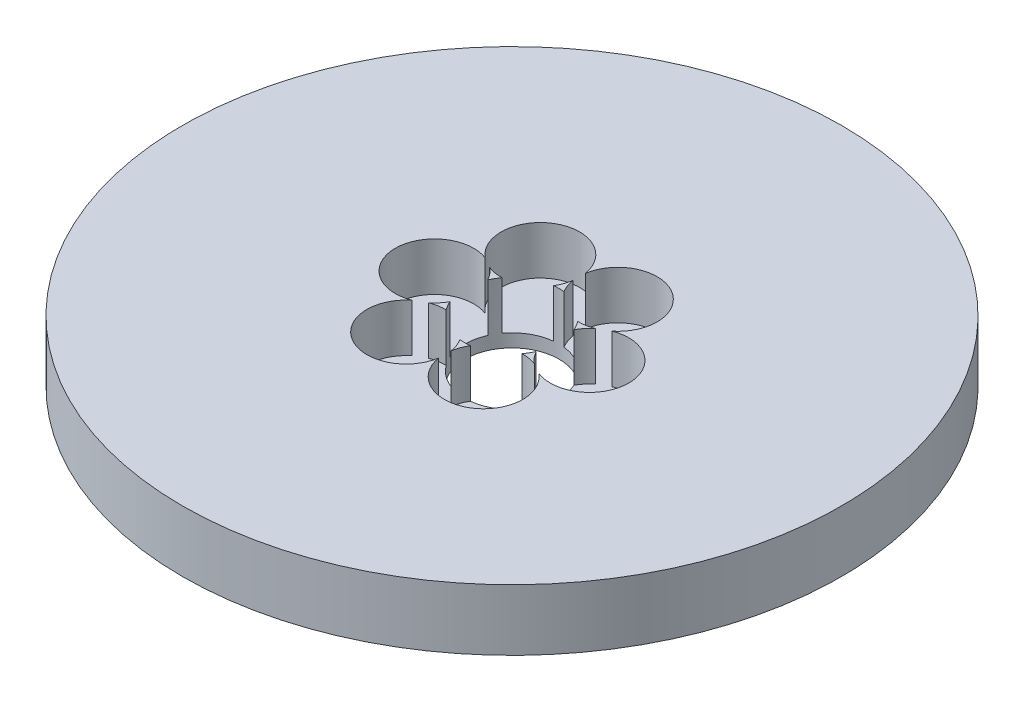
ISO-10303-21;
HEADER;
FILE_DESCRIPTION(('STEP AP214'),'2;1');
FILE_NAME('part.step','',(''),(''),'','','');
FILE_SCHEMA(('AUTOMOTIVE_DESIGN { 1 0 10303 214 1 1 1 1 }'));
ENDSEC;
DATA;
#1=APPLICATION_CONTEXT('core data for automotive mechanical design processes');
#2=APPLICATION_PROTOCOL_DEFINITION('international standard','automotive_design',2000,#1);
#3=PRODUCT_CONTEXT('',#1,'mechanical');
#4=PRODUCT('Part','Part','',(#3));
#5=PRODUCT_RELATED_PRODUCT_CATEGORY('part','',(#4));
#6=PRODUCT_DEFINITION_FORMATION('','',#4);
#7=PRODUCT_DEFINITION_CONTEXT('part definition',#1,'design');
#8=PRODUCT_DEFINITION('design','',#6,#7);
#9=PRODUCT_DEFINITION_SHAPE('','',#8);
#10=(LENGTH_UNIT() NAMED_UNIT(*) SI_UNIT(.MILLI.,.METRE.));
#11=(NAMED_UNIT(*) PLANE_ANGLE_UNIT() SI_UNIT($,.RADIAN.));
#12=(NAMED_UNIT(*) SI_UNIT($,.STERADIAN.) SOLID_ANGLE_UNIT());
#13=UNCERTAINTY_MEASURE_WITH_UNIT(LENGTH_MEASURE(1.E-05),#10,'distance_accuracy_value','');
#14=(GEOMETRIC_REPRESENTATION_CONTEXT(3) GLOBAL_UNCERTAINTY_ASSIGNED_CONTEXT((#13)) GLOBAL_UNIT_ASSIGNED_CONTEXT((#10,
#11,#12)) REPRESENTATION_CONTEXT('',''));
#15=CARTESIAN_POINT('',(0.,0.,0.));
#16=DIRECTION('',(0.,0.,1.));
#17=DIRECTION('',(1.,0.,0.));
#18=AXIS2_PLACEMENT_3D('',#15,#16,#17);
#19=CARTESIAN_POINT('',(0.,13.,0.));
#20=DIRECTION('',(0.,1.,0.));
#21=DIRECTION('',(0.,0.,1.));
#22=AXIS2_PLACEMENT_3D('',#19,#20,#21);
#23=PLANE('',#22);
#24=CARTESIAN_POINT('',(-8.23171814676589,13.,14.2577540637853));
#25=DIRECTION('',(0.,1.,0.));
#26=DIRECTION('',(0.86602540378444,0.,0.499999999999998));
#27=AXIS2_PLACEMENT_3D('',#24,#25,#26);
#28=CIRCLE('',#27,8.33407657568509);
#29=CARTESIAN_POINT('',(-8.05530373037074,13.,5.92554485355357));
#30=VERTEX_POINT('',#29);
#31=CARTESIAN_POINT('',(-11.219864250821,13.,6.47779164548255));
#32=VERTEX_POINT('',#31);
#33=EDGE_CURVE('E298',#30,#32,#28,.T.);
#34=ORIENTED_EDGE('',*,*,#33,.F.);
#35=CARTESIAN_POINT('',(0.,13.,0.));
#36=DIRECTION('',(0.,1.,0.));
#37=DIRECTION('',(0.,0.,1.));
#38=AXIS2_PLACEMENT_3D('',#35,#36,#37);
#39=CIRCLE('',#38,10.);
#40=CARTESIAN_POINT('',(-9.15932423962689,13.,4.01332523892386));
#41=VERTEX_POINT('',#40);
#42=EDGE_CURVE('E329',#41,#30,#39,.T.);
#43=ORIENTED_EDGE('',*,*,#42,.F.);
#44=CARTESIAN_POINT('',(-16.4634362935318,13.,0.));
#45=DIRECTION('',(0.,1.,0.));
#46=DIRECTION('',(0.,0.,1.));
#47=AXIS2_PLACEMENT_3D('',#44,#45,#46);
#48=CIRCLE('',#47,8.33407657568509);
#49=EDGE_CURVE('E328',#32,#41,#48,.T.);
#50=ORIENTED_EDGE('',*,*,#49,.F.);
#51=EDGE_LOOP('',(#34,#43,#50));
#52=FACE_BOUND('',#51,.T.);
#53=ADVANCED_FACE('F39',(#52),#23,.T.);
#54=CARTESIAN_POINT('',(-8.23171814676609,13.,-14.2577540637852));
#55=DIRECTION('',(0.,1.,0.));
#56=DIRECTION('',(-0.866025403784433,0.,0.50000000000001));
#57=AXIS2_PLACEMENT_3D('',#54,#55,#56);
#58=CIRCLE('',#57,8.33407657568509);
#59=CARTESIAN_POINT('',(-11.2198642508205,13.,-6.47779164548219));
#60=VERTEX_POINT('',#59);
#61=CARTESIAN_POINT('',(-8.05530373037083,13.,-5.92554485355345));
#62=VERTEX_POINT('',#61);
#63=EDGE_CURVE('E233',#60,#62,#58,.T.);
#64=ORIENTED_EDGE('',*,*,#63,.F.);
#65=CARTESIAN_POINT('',(-9.15932423962689,13.,-4.01332523892386));
#66=VERTEX_POINT('',#65);
#67=EDGE_CURVE('E324',#66,#60,#48,.T.);
#68=ORIENTED_EDGE('',*,*,#67,.F.);
#69=EDGE_CURVE('E333',#62,#66,#39,.T.);
#70=ORIENTED_EDGE('',*,*,#69,.F.);
#71=EDGE_LOOP('',(#64,#68,#70));
#72=FACE_BOUND('',#71,.T.);
#73=ADVANCED_FACE('F439',(#72),#23,.T.);
#74=CARTESIAN_POINT('',(8.23171814676579,13.,-14.2577540637854));
#75=DIRECTION('',(0.,1.,0.));
#76=DIRECTION('',(-0.866025403784443,0.,-0.499999999999992));
#77=AXIS2_PLACEMENT_3D('',#74,#75,#76);
#78=CIRCLE('',#77,8.33407657568509);
#79=CARTESIAN_POINT('',(8.0553037303707,13.,-5.92554485355362));
#80=VERTEX_POINT('',#79);
#81=CARTESIAN_POINT('',(11.2198642508212,13.,-6.47779164548273));
#82=VERTEX_POINT('',#81);
#83=EDGE_CURVE('E251',#80,#82,#78,.T.);
#84=ORIENTED_EDGE('',*,*,#83,.F.);
#85=CARTESIAN_POINT('',(9.15932423962689,13.,-4.01332523892386));
#86=VERTEX_POINT('',#85);
#87=EDGE_CURVE('E392',#86,#80,#39,.T.);
#88=ORIENTED_EDGE('',*,*,#87,.F.);
#89=CARTESIAN_POINT('',(16.4634362935318,13.,0.));
#90=DIRECTION('',(0.,1.,0.));
#91=DIRECTION('',(0.,0.,-1.));
#92=AXIS2_PLACEMENT_3D('',#89,#90,#91);
#93=CIRCLE('',#92,8.33407657568509);
#94=EDGE_CURVE('E263',#82,#86,#93,.T.);
#95=ORIENTED_EDGE('',*,*,#94,.F.);
#96=EDGE_LOOP('',(#84,#88,#95));
#97=FACE_BOUND('',#96,.T.);
#98=ADVANCED_FACE('F450',(#97),#23,.T.);
#99=CARTESIAN_POINT('',(9.15932423962689,13.,4.01332523892386));
#100=VERTEX_POINT('',#99);
#101=CARTESIAN_POINT('',(11.2198642508207,13.,6.47779164548237));
#102=VERTEX_POINT('',#101);
#103=EDGE_CURVE('E262',#100,#102,#93,.T.);
#104=ORIENTED_EDGE('',*,*,#103,.F.);
#105=CARTESIAN_POINT('',(8.05530373037078,13.,5.92554485355351));
#106=VERTEX_POINT('',#105);
#107=EDGE_CURVE('E394',#106,#100,#39,.T.);
#108=ORIENTED_EDGE('',*,*,#107,.F.);
#109=CARTESIAN_POINT('',(8.23171814676599,13.,14.2577540637853));
#110=DIRECTION('',(0.,1.,0.));
#111=DIRECTION('',(0.866025403784436,0.,-0.500000000000004));
#112=AXIS2_PLACEMENT_3D('',#109,#110,#111);
#113=CIRCLE('',#112,8.33407657568509);
#114=EDGE_CURVE('E280',#102,#106,#113,.T.);
#115=ORIENTED_EDGE('',*,*,#114,.F.);
#116=EDGE_LOOP('',(#104,#108,#115));
#117=FACE_BOUND('',#116,.T.);
#118=ADVANCED_FACE('F470',(#117),#23,.T.);
#119=CARTESIAN_POINT('',(1.10402050925618,13.,9.9388700924774));
#120=VERTEX_POINT('',#119);
#121=CARTESIAN_POINT('',(0.,13.,12.9555832909651));
#122=VERTEX_POINT('',#121);
#123=EDGE_CURVE('E276',#120,#122,#113,.T.);
#124=ORIENTED_EDGE('',*,*,#123,.F.);
#125=CARTESIAN_POINT('',(-1.10402050925611,13.,9.93887009247741));
#126=VERTEX_POINT('',#125);
#127=EDGE_CURVE('E331',#126,#120,#39,.T.);
#128=ORIENTED_EDGE('',*,*,#127,.F.);
#129=EDGE_CURVE('E300',#122,#126,#28,.T.);
#130=ORIENTED_EDGE('',*,*,#129,.F.);
#131=EDGE_LOOP('',(#124,#128,#130));
#132=FACE_BOUND('',#131,.T.);
#133=ADVANCED_FACE('F405',(#132),#23,.T.);
#134=CARTESIAN_POINT('',(-1.35308431126191E-13,13.,-12.9555832909651));
#135=VERTEX_POINT('',#134);
#136=CARTESIAN_POINT('',(1.10402050925604,13.,-9.93887009247742));
#137=VERTEX_POINT('',#136);
#138=EDGE_CURVE('E215',#135,#137,#78,.T.);
#139=ORIENTED_EDGE('',*,*,#138,.F.);
#140=CARTESIAN_POINT('',(-1.10402050925625,13.,-9.93887009247739));
#141=VERTEX_POINT('',#140);
#142=EDGE_CURVE('E234',#141,#135,#58,.T.);
#143=ORIENTED_EDGE('',*,*,#142,.F.);
#144=EDGE_CURVE('E252',#137,#141,#39,.T.);
#145=ORIENTED_EDGE('',*,*,#144,.F.);
#146=EDGE_LOOP('',(#139,#143,#145));
#147=FACE_BOUND('',#146,.T.);
#148=ADVANCED_FACE('F253',(#147),#23,.T.);
#149=CARTESIAN_POINT('',(-16.4634362935318,2.77919516842391,0.));
#150=DIRECTION('',(0.,1.,0.));
#151=DIRECTION('',(0.,0.,1.));
#152=AXIS2_PLACEMENT_3D('',#149,#150,#151);
#153=CYLINDRICAL_SURFACE('',#152,8.33407657568509);
#154=CARTESIAN_POINT('',(-16.4634362935318,2.77919516842391,0.));
#155=DIRECTION('',(0.,1.,0.));
#156=DIRECTION('',(0.,0.,1.));
#157=AXIS2_PLACEMENT_3D('',#154,#155,#156);
#158=CIRCLE('',#157,8.33407657568509);
#159=CARTESIAN_POINT('',(-11.219864250821,2.77919516842391,6.47779164548255));
#160=VERTEX_POINT('',#159);
#161=CARTESIAN_POINT('',(-9.15932423962689,2.77919516842391,4.01332523892386));
#162=VERTEX_POINT('',#161);
#163=EDGE_CURVE('E65',#160,#162,#158,.T.);
#164=ORIENTED_EDGE('',*,*,#163,.F.);
#165=DIRECTION('',(0.,1.,0.));
#166=VECTOR('',#165,1.);
#167=CARTESIAN_POINT('',(-11.219864250821,7.88959758421196,6.47779164548255));
#168=LINE('',#167,#166);
#169=EDGE_CURVE('E306',#160,#32,#168,.T.);
#170=ORIENTED_EDGE('',*,*,#169,.T.);
#171=ORIENTED_EDGE('',*,*,#49,.T.);
#172=DIRECTION('',(0.,1.,0.));
#173=VECTOR('',#172,1.);
#174=CARTESIAN_POINT('',(-9.15932423962689,7.88959758421196,4.01332523892386));
#175=LINE('',#174,#173);
#176=EDGE_CURVE('E347',#41,#162,#175,.F.);
#177=ORIENTED_EDGE('',*,*,#176,.T.);
#178=EDGE_LOOP('',(#164,#170,#171,#177));
#179=FACE_BOUND('',#178,.T.);
#180=ADVANCED_FACE('F458',(#179),#153,.F.);
#181=CARTESIAN_POINT('',(-13.4752901894774,13.,-7.77996241830302));
#182=VERTEX_POINT('',#181);
#183=CARTESIAN_POINT('',(-13.4752901894768,13.,7.77996241830277));
#184=VERTEX_POINT('',#183);
#185=EDGE_CURVE('E327',#182,#184,#48,.T.);
#186=ORIENTED_EDGE('',*,*,#185,.T.);
#187=DIRECTION('',(0.,1.,0.));
#188=VECTOR('',#187,1.);
#189=CARTESIAN_POINT('',(-13.4752901894768,7.88959758421196,7.77996241830277));
#190=LINE('',#189,#188);
#191=CARTESIAN_POINT('',(-13.4752901894768,2.77919516842391,7.77996241830277));
#192=VERTEX_POINT('',#191);
#193=EDGE_CURVE('E304',#184,#192,#190,.F.);
#194=ORIENTED_EDGE('',*,*,#193,.T.);
#195=CARTESIAN_POINT('',(-13.4752901894774,2.77919516842391,-7.77996241830302));
#196=VERTEX_POINT('',#195);
#197=EDGE_CURVE('E322',#196,#192,#158,.T.);
#198=ORIENTED_EDGE('',*,*,#197,.F.);
#199=DIRECTION('',(0.,1.,0.));
#200=VECTOR('',#199,1.);
#201=CARTESIAN_POINT('',(-13.4752901894774,7.88959758421196,-7.77996241830302));
#202=LINE('',#201,#200);
#203=EDGE_CURVE('E226',#196,#182,#202,.T.);
#204=ORIENTED_EDGE('',*,*,#203,.T.);
#205=EDGE_LOOP('',(#186,#194,#198,#204));
#206=FACE_BOUND('',#205,.T.);
#207=ADVANCED_FACE('F423',(#206),#153,.F.);
#208=CARTESIAN_POINT('',(0.,13.,0.));
#209=DIRECTION('',(0.,-1.,0.));
#210=DIRECTION('',(0.,0.,-1.));
#211=AXIS2_PLACEMENT_3D('',#208,#209,#210);
#212=CYLINDRICAL_SURFACE('',#211,70.);
#213=CARTESIAN_POINT('',(0.,13.,0.));
#214=DIRECTION('',(0.,1.,0.));
#215=DIRECTION('',(0.,0.,1.));
#216=AXIS2_PLACEMENT_3D('',#213,#214,#215);
#217=CIRCLE('',#216,70.);
#218=CARTESIAN_POINT('',(0.,13.,-70.));
#219=VERTEX_POINT('',#218);
#220=EDGE_CURVE('E337',#219,#219,#217,.T.);
#221=CARTESIAN_POINT('',(0.,0.,0.));
#222=DIRECTION('',(0.,1.,0.));
#223=DIRECTION('',(0.,0.,1.));
#224=AXIS2_PLACEMENT_3D('',#221,#222,#223);
#225=CIRCLE('',#224,70.);
#226=CARTESIAN_POINT('',(0.,0.,-70.));
#227=VERTEX_POINT('',#226);
#228=EDGE_CURVE('E334',#227,#227,#225,.T.);
#229=CARTESIAN_POINT('',(0.,13.,-70.));
#230=CARTESIAN_POINT('',(0.,12.8645833333333,-70.));
#231=CARTESIAN_POINT('',(0.,12.7291666666667,-70.));
#232=CARTESIAN_POINT('',(0.,12.4583333333333,-70.));
#233=CARTESIAN_POINT('',(0.,12.3229166666667,-70.));
#234=CARTESIAN_POINT('',(0.,12.0520833333333,-70.));
#235=CARTESIAN_POINT('',(0.,11.9166666666667,-70.));
#236=CARTESIAN_POINT('',(0.,11.6458333333333,-70.));
#237=CARTESIAN_POINT('',(0.,11.5104166666667,-70.));
#238=CARTESIAN_POINT('',(0.,11.2395833333333,-70.));
#239=CARTESIAN_POINT('',(0.,11.1041666666667,-70.));
#240=CARTESIAN_POINT('',(0.,10.8333333333333,-70.));
#241=CARTESIAN_POINT('',(0.,10.6979166666667,-70.));
#242=CARTESIAN_POINT('',(0.,10.4270833333333,-70.));
#243=CARTESIAN_POINT('',(0.,10.2916666666667,-70.));
#244=CARTESIAN_POINT('',(0.,10.0208333333333,-70.));
#245=CARTESIAN_POINT('',(0.,9.88541666666667,-70.));
#246=CARTESIAN_POINT('',(0.,9.61458333333333,-70.));
#247=CARTESIAN_POINT('',(0.,9.47916666666667,-70.));
#248=CARTESIAN_POINT('',(0.,9.20833333333333,-70.));
#249=CARTESIAN_POINT('',(0.,9.07291666666667,-70.));
#250=CARTESIAN_POINT('',(0.,8.80208333333333,-70.));
#251=CARTESIAN_POINT('',(0.,8.66666666666667,-70.));
#252=CARTESIAN_POINT('',(0.,8.39583333333333,-70.));
#253=CARTESIAN_POINT('',(0.,8.26041666666667,-70.));
#254=CARTESIAN_POINT('',(0.,7.98958333333333,-70.));
#255=CARTESIAN_POINT('',(0.,7.85416666666667,-70.));
#256=CARTESIAN_POINT('',(0.,7.58333333333333,-70.));
#257=CARTESIAN_POINT('',(0.,7.44791666666667,-70.));
#258=CARTESIAN_POINT('',(0.,7.17708333333333,-70.));
#259=CARTESIAN_POINT('',(0.,7.04166666666667,-70.));
#260=CARTESIAN_POINT('',(0.,6.77083333333333,-70.));
#261=CARTESIAN_POINT('',(0.,6.63541666666667,-70.));
#262=CARTESIAN_POINT('',(0.,6.36458333333333,-70.));
#263=CARTESIAN_POINT('',(0.,6.22916666666667,-70.));
#264=CARTESIAN_POINT('',(0.,5.95833333333333,-70.));
#265=CARTESIAN_POINT('',(0.,5.82291666666667,-70.));
#266=CARTESIAN_POINT('',(0.,5.55208333333333,-70.));
#267=CARTESIAN_POINT('',(0.,5.41666666666667,-70.));
#268=CARTESIAN_POINT('',(0.,5.14583333333333,-70.));
#269=CARTESIAN_POINT('',(0.,5.01041666666667,-70.));
#270=CARTESIAN_POINT('',(0.,4.73958333333333,-70.));
#271=CARTESIAN_POINT('',(0.,4.60416666666667,-70.));
#272=CARTESIAN_POINT('',(0.,4.33333333333333,-70.));
#273=CARTESIAN_POINT('',(0.,4.19791666666667,-70.));
#274=CARTESIAN_POINT('',(0.,3.92708333333333,-70.));
#275=CARTESIAN_POINT('',(0.,3.79166666666667,-70.));
#276=CARTESIAN_POINT('',(0.,3.52083333333333,-70.));
#277=CARTESIAN_POINT('',(0.,3.38541666666667,-70.));
#278=CARTESIAN_POINT('',(0.,3.11458333333333,-70.));
#279=CARTESIAN_POINT('',(0.,2.97916666666667,-70.));
#280=CARTESIAN_POINT('',(0.,2.70833333333333,-70.));
#281=CARTESIAN_POINT('',(0.,2.57291666666667,-70.));
#282=CARTESIAN_POINT('',(0.,2.30208333333333,-70.));
#283=CARTESIAN_POINT('',(0.,2.16666666666667,-70.));
#284=CARTESIAN_POINT('',(0.,1.89583333333333,-70.));
#285=CARTESIAN_POINT('',(0.,1.76041666666667,-70.));
#286=CARTESIAN_POINT('',(0.,1.48958333333333,-70.));
#287=CARTESIAN_POINT('',(0.,1.35416666666667,-70.));
#288=CARTESIAN_POINT('',(0.,1.08333333333333,-70.));
#289=CARTESIAN_POINT('',(0.,0.947916666666667,-70.));
#290=CARTESIAN_POINT('',(0.,0.677083333333334,-70.));
#291=CARTESIAN_POINT('',(0.,0.541666666666667,-70.));
#292=CARTESIAN_POINT('',(0.,0.270833333333334,-70.));
#293=CARTESIAN_POINT('',(0.,0.135416666666667,-70.));
#294=CARTESIAN_POINT('',(0.,0.,-70.));
#295=B_SPLINE_CURVE_WITH_KNOTS('',3,(#229,#230,#231,#232,#233,#234,#235,#236,#237,#238,#239,
#240,#241,#242,#243,#244,#245,#246,#247,#248,#249,#250,#251,#252,#253,#254,#255,#256,#257,#258,
#259,#260,#261,#262,#263,#264,#265,#266,#267,#268,#269,#270,#271,#272,#273,#274,#275,#276,#277,
#278,#279,#280,#281,#282,#283,#284,#285,#286,#287,#288,#289,#290,#291,#292,#293,#294),
.UNSPECIFIED.,.F.,.F.,(4,2,2,2,2,2,2,2,2,2,2,2,2,2,2,2,2,2,2,2,2,2,2,2,2,2,2,2,2,2,2,2,4),(0.,
0.406249999999999,0.812499999999999,1.21875,1.625,2.03125,2.4375,2.84375,3.25,3.65625,4.0625,
4.46875,4.875,5.28125,5.6875,6.09375,6.5,6.90625,7.3125,7.71875,8.125,8.53125,8.9375,9.34375,
9.75,10.15625,10.5625,10.96875,11.375,11.78125,12.1875,12.59375,13.),.UNSPECIFIED.);
#296=EDGE_CURVE('BSEAM41',#219,#227,#295,.T.);
#297=ORIENTED_EDGE('',*,*,#220,.F.);
#298=ORIENTED_EDGE('',*,*,#228,.T.);
#299=ORIENTED_EDGE('',*,*,#296,.T.);
#300=ORIENTED_EDGE('',*,*,#296,.F.);
#301=EDGE_LOOP('',(#297,#299,#298,#300));
#302=FACE_BOUND('',#301,.T.);
#303=ADVANCED_FACE('F41',(#302),#212,.T.);
#304=CARTESIAN_POINT('',(0.,13.,15.5599248366055));
#305=VERTEX_POINT('',#304);
#306=EDGE_CURVE('E289',#184,#305,#28,.T.);
#307=ORIENTED_EDGE('',*,*,#306,.F.);
#308=ORIENTED_EDGE('',*,*,#185,.F.);
#309=CARTESIAN_POINT('',(-1.6306400674182E-13,13.,-15.5599248366055));
#310=VERTEX_POINT('',#309);
#311=EDGE_CURVE('E229',#310,#182,#58,.T.);
#312=ORIENTED_EDGE('',*,*,#311,.F.);
#313=CARTESIAN_POINT('',(13.4752901894765,13.,-7.77996241830265));
#314=VERTEX_POINT('',#313);
#315=EDGE_CURVE('E218',#314,#310,#78,.T.);
#316=ORIENTED_EDGE('',*,*,#315,.F.);
#317=CARTESIAN_POINT('',(13.4752901894771,13.,7.77996241830289));
#318=VERTEX_POINT('',#317);
#319=EDGE_CURVE('E257',#318,#314,#93,.T.);
#320=ORIENTED_EDGE('',*,*,#319,.F.);
#321=EDGE_CURVE('E269',#305,#318,#113,.T.);
#322=ORIENTED_EDGE('',*,*,#321,.F.);
#323=EDGE_LOOP('',(#307,#308,#312,#316,#320,#322));
#324=FACE_BOUND('',#323,.T.);
#325=ORIENTED_EDGE('',*,*,#220,.T.);
#326=EDGE_LOOP('',(#325));
#327=FACE_BOUND('',#326,.T.);
#328=ADVANCED_FACE('F418',(#324,#327),#23,.T.);
#329=CARTESIAN_POINT('',(0.,0.,0.));
#330=DIRECTION('',(0.,1.,0.));
#331=DIRECTION('',(0.,0.,1.));
#332=AXIS2_PLACEMENT_3D('',#329,#330,#331);
#333=PLANE('',#332);
#334=CARTESIAN_POINT('',(0.,0.,0.));
#335=DIRECTION('',(0.,1.,0.));
#336=DIRECTION('',(0.,0.,1.));
#337=AXIS2_PLACEMENT_3D('',#334,#335,#336);
#338=CIRCLE('',#337,10.);
#339=CARTESIAN_POINT('',(0.,0.,10.));
#340=VERTEX_POINT('',#339);
#341=EDGE_CURVE('E323',#340,#340,#338,.T.);
#342=ORIENTED_EDGE('',*,*,#341,.T.);
#343=EDGE_LOOP('',(#342));
#344=FACE_BOUND('',#343,.T.);
#345=ORIENTED_EDGE('',*,*,#228,.F.);
#346=EDGE_LOOP('',(#345));
#347=FACE_BOUND('',#346,.T.);
#348=ADVANCED_FACE('F451',(#344,#347),#333,.F.);
#349=CARTESIAN_POINT('',(0.,13.,0.));
#350=DIRECTION('',(0.,-1.,0.));
#351=DIRECTION('',(0.,0.,-1.));
#352=AXIS2_PLACEMENT_3D('',#349,#350,#351);
#353=CYLINDRICAL_SURFACE('',#352,10.);
#354=DIRECTION('',(0.,1.,0.));
#355=VECTOR('',#354,1.);
#356=CARTESIAN_POINT('',(-8.05530373037075,7.88959758421196,5.92554485355357));
#357=LINE('',#356,#355);
#358=CARTESIAN_POINT('',(-8.05530373037074,2.77919516842391,5.92554485355357));
#359=VERTEX_POINT('',#358);
#360=EDGE_CURVE('E311',#359,#30,#357,.T.);
#361=ORIENTED_EDGE('',*,*,#360,.F.);
#362=CARTESIAN_POINT('',(0.,2.77919516842391,0.));
#363=DIRECTION('',(0.,1.,0.));
#364=DIRECTION('',(0.,0.,1.));
#365=AXIS2_PLACEMENT_3D('',#362,#363,#364);
#366=CIRCLE('',#365,10.);
#367=CARTESIAN_POINT('',(-1.10402050925611,2.77919516842391,9.93887009247741));
#368=VERTEX_POINT('',#367);
#369=EDGE_CURVE('E312',#359,#368,#366,.T.);
#370=ORIENTED_EDGE('',*,*,#369,.T.);
#371=DIRECTION('',(0.,1.,0.));
#372=VECTOR('',#371,1.);
#373=CARTESIAN_POINT('',(-1.10402050925611,7.88959758421196,9.93887009247741));
#374=LINE('',#373,#372);
#375=EDGE_CURVE('E313',#126,#368,#374,.F.);
#376=ORIENTED_EDGE('',*,*,#375,.F.);
#377=ORIENTED_EDGE('',*,*,#127,.T.);
#378=DIRECTION('',(0.,1.,0.));
#379=VECTOR('',#378,1.);
#380=CARTESIAN_POINT('',(1.10402050925618,7.88959758421196,9.9388700924774));
#381=LINE('',#380,#379);
#382=CARTESIAN_POINT('',(1.10402050925618,2.77919516842391,9.9388700924774));
#383=VERTEX_POINT('',#382);
#384=EDGE_CURVE('E11',#383,#120,#381,.T.);
#385=ORIENTED_EDGE('',*,*,#384,.F.);
#386=CARTESIAN_POINT('',(8.05530373037078,2.77919516842391,5.92554485355351));
#387=VERTEX_POINT('',#386);
#388=EDGE_CURVE('E317',#383,#387,#366,.T.);
#389=ORIENTED_EDGE('',*,*,#388,.T.);
#390=DIRECTION('',(0.,1.,0.));
#391=VECTOR('',#390,1.);
#392=CARTESIAN_POINT('',(8.05530373037078,7.88959758421196,5.92554485355351));
#393=LINE('',#392,#391);
#394=EDGE_CURVE('E50',#106,#387,#393,.F.);
#395=ORIENTED_EDGE('',*,*,#394,.F.);
#396=ORIENTED_EDGE('',*,*,#107,.T.);
#397=DIRECTION('',(0.,1.,0.));
#398=VECTOR('',#397,1.);
#399=CARTESIAN_POINT('',(9.15932423962689,7.88959758421196,4.01332523892386));
#400=LINE('',#399,#398);
#401=CARTESIAN_POINT('',(9.15932423962689,2.77919516842391,4.01332523892386));
#402=VERTEX_POINT('',#401);
#403=EDGE_CURVE('E360',#402,#100,#400,.T.);
#404=ORIENTED_EDGE('',*,*,#403,.F.);
#405=CARTESIAN_POINT('',(9.15932423962689,2.77919516842391,-4.01332523892386));
#406=VERTEX_POINT('',#405);
#407=EDGE_CURVE('E374',#402,#406,#366,.T.);
#408=ORIENTED_EDGE('',*,*,#407,.T.);
#409=DIRECTION('',(0.,1.,0.));
#410=VECTOR('',#409,1.);
#411=CARTESIAN_POINT('',(9.15932423962689,7.88959758421196,-4.01332523892386));
#412=LINE('',#411,#410);
#413=EDGE_CURVE('E354',#86,#406,#412,.F.);
#414=ORIENTED_EDGE('',*,*,#413,.F.);
#415=ORIENTED_EDGE('',*,*,#87,.T.);
#416=DIRECTION('',(0.,1.,0.));
#417=VECTOR('',#416,1.);
#418=CARTESIAN_POINT('',(8.0553037303707,7.88959758421196,-5.92554485355362));
#419=LINE('',#418,#417);
#420=CARTESIAN_POINT('',(8.0553037303707,2.77919516842391,-5.92554485355362));
#421=VERTEX_POINT('',#420);
#422=EDGE_CURVE('E352',#421,#80,#419,.T.);
#423=ORIENTED_EDGE('',*,*,#422,.F.);
#424=CARTESIAN_POINT('',(1.10402050925604,2.77919516842391,-9.93887009247742));
#425=VERTEX_POINT('',#424);
#426=EDGE_CURVE('E380',#421,#425,#366,.T.);
#427=ORIENTED_EDGE('',*,*,#426,.T.);
#428=DIRECTION('',(0.,1.,0.));
#429=VECTOR('',#428,1.);
#430=CARTESIAN_POINT('',(1.10402050925604,7.88959758421196,-9.93887009247742));
#431=LINE('',#430,#429);
#432=EDGE_CURVE('E351',#137,#425,#431,.F.);
#433=ORIENTED_EDGE('',*,*,#432,.F.);
#434=ORIENTED_EDGE('',*,*,#144,.T.);
#435=DIRECTION('',(0.,1.,0.));
#436=VECTOR('',#435,1.);
#437=CARTESIAN_POINT('',(-1.10402050925625,7.88959758421196,-9.93887009247739));
#438=LINE('',#437,#436);
#439=CARTESIAN_POINT('',(-1.10402050925625,2.77919516842391,-9.93887009247739));
#440=VERTEX_POINT('',#439);
#441=EDGE_CURVE('E245',#440,#141,#438,.T.);
#442=ORIENTED_EDGE('',*,*,#441,.F.);
#443=CARTESIAN_POINT('',(-8.05530373037083,2.77919516842391,-5.92554485355345));
#444=VERTEX_POINT('',#443);
#445=EDGE_CURVE('E318',#440,#444,#366,.T.);
#446=ORIENTED_EDGE('',*,*,#445,.T.);
#447=DIRECTION('',(0.,1.,0.));
#448=VECTOR('',#447,1.);
#449=CARTESIAN_POINT('',(-8.05530373037083,7.88959758421196,-5.92554485355345));
#450=LINE('',#449,#448);
#451=EDGE_CURVE('E305',#62,#444,#450,.F.);
#452=ORIENTED_EDGE('',*,*,#451,.F.);
#453=ORIENTED_EDGE('',*,*,#69,.T.);
#454=DIRECTION('',(0.,1.,0.));
#455=VECTOR('',#454,1.);
#456=CARTESIAN_POINT('',(-9.15932423962689,7.88959758421196,-4.01332523892386));
#457=LINE('',#456,#455);
#458=CARTESIAN_POINT('',(-9.15932423962689,2.77919516842391,-4.01332523892386));
#459=VERTEX_POINT('',#458);
#460=EDGE_CURVE('E346',#459,#66,#457,.T.);
#461=ORIENTED_EDGE('',*,*,#460,.F.);
#462=CARTESIAN_POINT('',(0.,2.77919516842391,0.));
#463=DIRECTION('',(0.,1.,0.));
#464=DIRECTION('',(0.,0.,1.));
#465=AXIS2_PLACEMENT_3D('',#462,#463,#464);
#466=CIRCLE('',#465,10.);
#467=EDGE_CURVE('E341',#459,#162,#466,.T.);
#468=ORIENTED_EDGE('',*,*,#467,.T.);
#469=ORIENTED_EDGE('',*,*,#176,.F.);
#470=ORIENTED_EDGE('',*,*,#42,.T.);
#471=EDGE_LOOP('',(#361,#370,#376,#377,#385,#389,#395,#396,#404,#408,#414,#415,#423,#427,#433,
#434,#442,#446,#452,#453,#461,#468,#469,#470));
#472=FACE_BOUND('',#471,.T.);
#473=ORIENTED_EDGE('',*,*,#341,.F.);
#474=EDGE_LOOP('',(#473));
#475=FACE_BOUND('',#474,.T.);
#476=ADVANCED_FACE('F375',(#472,#475),#353,.F.);
#477=ORIENTED_EDGE('',*,*,#67,.T.);
#478=DIRECTION('',(0.,1.,0.));
#479=VECTOR('',#478,1.);
#480=CARTESIAN_POINT('',(-11.2198642508205,7.88959758421196,-6.47779164548219));
#481=LINE('',#480,#479);
#482=CARTESIAN_POINT('',(-11.2198642508205,2.77919516842391,-6.47779164548219));
#483=VERTEX_POINT('',#482);
#484=EDGE_CURVE('E294',#60,#483,#481,.F.);
#485=ORIENTED_EDGE('',*,*,#484,.T.);
#486=EDGE_CURVE('E319',#459,#483,#158,.T.);
#487=ORIENTED_EDGE('',*,*,#486,.F.);
#488=ORIENTED_EDGE('',*,*,#460,.T.);
#489=EDGE_LOOP('',(#477,#485,#487,#488));
#490=FACE_BOUND('',#489,.T.);
#491=ADVANCED_FACE('F389',(#490),#153,.F.);
#492=CARTESIAN_POINT('',(-16.4634362935318,2.77919516842391,0.));
#493=DIRECTION('',(0.,1.,0.));
#494=DIRECTION('',(0.,0.,1.));
#495=AXIS2_PLACEMENT_3D('',#492,#493,#494);
#496=PLANE('',#495);
#497=CARTESIAN_POINT('',(-8.23171814676609,2.77919516842391,-14.2577540637852));
#498=DIRECTION('',(0.,1.,0.));
#499=DIRECTION('',(-0.866025403784433,0.,0.50000000000001));
#500=AXIS2_PLACEMENT_3D('',#497,#498,#499);
#501=CIRCLE('',#500,8.33407657568509);
#502=CARTESIAN_POINT('',(-1.61329283265843E-13,2.77919516842391,-15.5599248366055));
#503=VERTEX_POINT('',#502);
#504=EDGE_CURVE('E202',#503,#196,#501,.T.);
#505=ORIENTED_EDGE('',*,*,#504,.T.);
#506=ORIENTED_EDGE('',*,*,#197,.T.);
#507=CARTESIAN_POINT('',(-8.23171814676589,2.77919516842391,14.2577540637853));
#508=DIRECTION('',(0.,1.,0.));
#509=DIRECTION('',(0.86602540378444,0.,0.499999999999998));
#510=AXIS2_PLACEMENT_3D('',#507,#508,#509);
#511=CIRCLE('',#510,8.33407657568509);
#512=CARTESIAN_POINT('',(0.,2.77919516842391,15.5599248366055));
#513=VERTEX_POINT('',#512);
#514=EDGE_CURVE('E296',#192,#513,#511,.T.);
#515=ORIENTED_EDGE('',*,*,#514,.T.);
#516=CARTESIAN_POINT('',(8.23171814676599,2.77919516842391,14.2577540637853));
#517=DIRECTION('',(0.,1.,0.));
#518=DIRECTION('',(0.866025403784436,0.,-0.500000000000004));
#519=AXIS2_PLACEMENT_3D('',#516,#517,#518);
#520=CIRCLE('',#519,8.33407657568509);
#521=CARTESIAN_POINT('',(13.4752901894771,2.77919516842391,7.77996241830289));
#522=VERTEX_POINT('',#521);
#523=EDGE_CURVE('E277',#513,#522,#520,.T.);
#524=ORIENTED_EDGE('',*,*,#523,.T.);
#525=CARTESIAN_POINT('',(16.4634362935318,2.77919516842391,0.));
#526=DIRECTION('',(0.,1.,0.));
#527=DIRECTION('',(0.,0.,-1.));
#528=AXIS2_PLACEMENT_3D('',#525,#526,#527);
#529=CIRCLE('',#528,8.33407657568509);
#530=CARTESIAN_POINT('',(13.4752901894765,2.77919516842391,-7.77996241830264));
#531=VERTEX_POINT('',#530);
#532=EDGE_CURVE('E208',#522,#531,#529,.T.);
#533=ORIENTED_EDGE('',*,*,#532,.T.);
#534=CARTESIAN_POINT('',(8.23171814676579,2.77919516842391,-14.2577540637854));
#535=DIRECTION('',(0.,1.,0.));
#536=DIRECTION('',(-0.866025403784443,0.,-0.499999999999992));
#537=AXIS2_PLACEMENT_3D('',#534,#535,#536);
#538=CIRCLE('',#537,8.33407657568509);
#539=EDGE_CURVE('E199',#531,#503,#538,.T.);
#540=ORIENTED_EDGE('',*,*,#539,.T.);
#541=EDGE_LOOP('',(#505,#506,#515,#524,#533,#540));
#542=FACE_BOUND('',#541,.T.);
#543=ORIENTED_EDGE('',*,*,#486,.T.);
#544=EDGE_CURVE('E53',#483,#444,#501,.T.);
#545=ORIENTED_EDGE('',*,*,#544,.T.);
#546=ORIENTED_EDGE('',*,*,#445,.F.);
#547=CARTESIAN_POINT('',(-1.35308431126191E-13,2.77919516842391,-12.9555832909651));
#548=VERTEX_POINT('',#547);
#549=EDGE_CURVE('E227',#440,#548,#501,.T.);
#550=ORIENTED_EDGE('',*,*,#549,.T.);
#551=EDGE_CURVE('E212',#548,#425,#538,.T.);
#552=ORIENTED_EDGE('',*,*,#551,.T.);
#553=ORIENTED_EDGE('',*,*,#426,.F.);
#554=CARTESIAN_POINT('',(11.2198642508212,2.77919516842391,-6.47779164548273));
#555=VERTEX_POINT('',#554);
#556=EDGE_CURVE('E211',#421,#555,#538,.T.);
#557=ORIENTED_EDGE('',*,*,#556,.T.);
#558=EDGE_CURVE('E256',#555,#406,#529,.T.);
#559=ORIENTED_EDGE('',*,*,#558,.T.);
#560=ORIENTED_EDGE('',*,*,#407,.F.);
#561=CARTESIAN_POINT('',(11.2198642508207,2.77919516842391,6.47779164548237));
#562=VERTEX_POINT('',#561);
#563=EDGE_CURVE('E259',#402,#562,#529,.T.);
#564=ORIENTED_EDGE('',*,*,#563,.T.);
#565=EDGE_CURVE('E271',#562,#387,#520,.T.);
#566=ORIENTED_EDGE('',*,*,#565,.T.);
#567=ORIENTED_EDGE('',*,*,#388,.F.);
#568=CARTESIAN_POINT('',(0.,2.77919516842391,12.9555832909651));
#569=VERTEX_POINT('',#568);
#570=EDGE_CURVE('E274',#383,#569,#520,.T.);
#571=ORIENTED_EDGE('',*,*,#570,.T.);
#572=EDGE_CURVE('E292',#569,#368,#511,.T.);
#573=ORIENTED_EDGE('',*,*,#572,.T.);
#574=ORIENTED_EDGE('',*,*,#369,.F.);
#575=EDGE_CURVE('E293',#359,#160,#511,.T.);
#576=ORIENTED_EDGE('',*,*,#575,.T.);
#577=ORIENTED_EDGE('',*,*,#163,.T.);
#578=ORIENTED_EDGE('',*,*,#467,.F.);
#579=EDGE_LOOP('',(#543,#545,#546,#550,#552,#553,#557,#559,#560,#564,#566,#567,#571,#573,#574,
#576,#577,#578));
#580=FACE_BOUND('',#579,.T.);
#581=ADVANCED_FACE('F205',(#542,#580),#496,.T.);
#582=CARTESIAN_POINT('',(8.23171814676599,2.77919516842391,14.2577540637853));
#583=DIRECTION('',(0.,1.,0.));
#584=DIRECTION('',(0.,0.,1.));
#585=AXIS2_PLACEMENT_3D('',#582,#583,#584);
#586=CYLINDRICAL_SURFACE('',#585,8.33407657568509);
#587=ORIENTED_EDGE('',*,*,#384,.T.);
#588=ORIENTED_EDGE('',*,*,#123,.T.);
#589=DIRECTION('',(0.,1.,0.));
#590=VECTOR('',#589,1.);
#591=CARTESIAN_POINT('',(0.,7.88959758421196,12.9555832909651));
#592=LINE('',#591,#590);
#593=EDGE_CURVE('E290',#569,#122,#592,.T.);
#594=ORIENTED_EDGE('',*,*,#593,.F.);
#595=ORIENTED_EDGE('',*,*,#570,.F.);
#596=EDGE_LOOP('',(#587,#588,#594,#595));
#597=FACE_BOUND('',#596,.T.);
#598=ADVANCED_FACE('F422',(#597),#586,.F.);
#599=CARTESIAN_POINT('',(16.4634362935318,2.77919516842391,0.));
#600=DIRECTION('',(0.,1.,0.));
#601=DIRECTION('',(0.,0.,1.));
#602=AXIS2_PLACEMENT_3D('',#599,#600,#601);
#603=CYLINDRICAL_SURFACE('',#602,8.33407657568509);
#604=ORIENTED_EDGE('',*,*,#403,.T.);
#605=ORIENTED_EDGE('',*,*,#103,.T.);
#606=DIRECTION('',(0.,1.,0.));
#607=VECTOR('',#606,1.);
#608=CARTESIAN_POINT('',(11.2198642508207,7.88959758421196,6.47779164548237));
#609=LINE('',#608,#607);
#610=EDGE_CURVE('E270',#562,#102,#609,.T.);
#611=ORIENTED_EDGE('',*,*,#610,.F.);
#612=ORIENTED_EDGE('',*,*,#563,.F.);
#613=EDGE_LOOP('',(#604,#605,#611,#612));
#614=FACE_BOUND('',#613,.T.);
#615=ADVANCED_FACE('F487',(#614),#603,.F.);
#616=CARTESIAN_POINT('',(8.23171814676579,2.77919516842391,-14.2577540637854));
#617=DIRECTION('',(0.,1.,0.));
#618=DIRECTION('',(0.,0.,1.));
#619=AXIS2_PLACEMENT_3D('',#616,#617,#618);
#620=CYLINDRICAL_SURFACE('',#619,8.33407657568509);
#621=ORIENTED_EDGE('',*,*,#422,.T.);
#622=ORIENTED_EDGE('',*,*,#83,.T.);
#623=DIRECTION('',(0.,1.,0.));
#624=VECTOR('',#623,1.);
#625=CARTESIAN_POINT('',(11.2198642508212,7.88959758421196,-6.47779164548273));
#626=LINE('',#625,#624);
#627=EDGE_CURVE('E281',#555,#82,#626,.T.);
#628=ORIENTED_EDGE('',*,*,#627,.F.);
#629=ORIENTED_EDGE('',*,*,#556,.F.);
#630=EDGE_LOOP('',(#621,#622,#628,#629));
#631=FACE_BOUND('',#630,.T.);
#632=ADVANCED_FACE('F434',(#631),#620,.F.);
#633=CARTESIAN_POINT('',(-8.23171814676589,2.77919516842391,14.2577540637853));
#634=DIRECTION('',(0.,1.,0.));
#635=DIRECTION('',(0.,0.,1.));
#636=AXIS2_PLACEMENT_3D('',#633,#634,#635);
#637=CYLINDRICAL_SURFACE('',#636,8.33407657568509);
#638=ORIENTED_EDGE('',*,*,#360,.T.);
#639=ORIENTED_EDGE('',*,*,#33,.T.);
#640=ORIENTED_EDGE('',*,*,#169,.F.);
#641=ORIENTED_EDGE('',*,*,#575,.F.);
#642=EDGE_LOOP('',(#638,#639,#640,#641));
#643=FACE_BOUND('',#642,.T.);
#644=ADVANCED_FACE('F427',(#643),#637,.F.);
#645=ORIENTED_EDGE('',*,*,#375,.T.);
#646=ORIENTED_EDGE('',*,*,#572,.F.);
#647=ORIENTED_EDGE('',*,*,#593,.T.);
#648=ORIENTED_EDGE('',*,*,#129,.T.);
#649=EDGE_LOOP('',(#645,#646,#647,#648));
#650=FACE_BOUND('',#649,.T.);
#651=ADVANCED_FACE('F430',(#650),#637,.F.);
#652=ORIENTED_EDGE('',*,*,#306,.T.);
#653=DIRECTION('',(0.,1.,0.));
#654=VECTOR('',#653,1.);
#655=CARTESIAN_POINT('',(0.,7.88959758421196,15.5599248366055));
#656=LINE('',#655,#654);
#657=EDGE_CURVE('E283',#305,#513,#656,.F.);
#658=ORIENTED_EDGE('',*,*,#657,.T.);
#659=ORIENTED_EDGE('',*,*,#514,.F.);
#660=ORIENTED_EDGE('',*,*,#193,.F.);
#661=EDGE_LOOP('',(#652,#658,#659,#660));
#662=FACE_BOUND('',#661,.T.);
#663=ADVANCED_FACE('F421',(#662),#637,.F.);
#664=CARTESIAN_POINT('',(-8.23171814676609,2.77919516842391,-14.2577540637852));
#665=DIRECTION('',(0.,1.,0.));
#666=DIRECTION('',(0.,0.,1.));
#667=AXIS2_PLACEMENT_3D('',#664,#665,#666);
#668=CYLINDRICAL_SURFACE('',#667,8.33407657568509);
#669=ORIENTED_EDGE('',*,*,#441,.T.);
#670=ORIENTED_EDGE('',*,*,#142,.T.);
#671=DIRECTION('',(0.,1.,0.));
#672=VECTOR('',#671,1.);
#673=CARTESIAN_POINT('',(-1.35308431126191E-13,7.88959758421196,-12.9555832909651));
#674=LINE('',#673,#672);
#675=EDGE_CURVE('E225',#548,#135,#674,.T.);
#676=ORIENTED_EDGE('',*,*,#675,.F.);
#677=ORIENTED_EDGE('',*,*,#549,.F.);
#678=EDGE_LOOP('',(#669,#670,#676,#677));
#679=FACE_BOUND('',#678,.T.);
#680=ADVANCED_FACE('F239',(#679),#668,.F.);
#681=ORIENTED_EDGE('',*,*,#504,.F.);
#682=DIRECTION('',(0.,1.,0.));
#683=VECTOR('',#682,1.);
#684=CARTESIAN_POINT('',(-1.61329283265843E-13,7.88959758421196,-15.5599248366055));
#685=LINE('',#684,#683);
#686=EDGE_CURVE('E216',#310,#503,#685,.F.);
#687=ORIENTED_EDGE('',*,*,#686,.F.);
#688=ORIENTED_EDGE('',*,*,#311,.T.);
#689=ORIENTED_EDGE('',*,*,#203,.F.);
#690=EDGE_LOOP('',(#681,#687,#688,#689));
#691=FACE_BOUND('',#690,.T.);
#692=ADVANCED_FACE('F221',(#691),#668,.F.);
#693=ORIENTED_EDGE('',*,*,#451,.T.);
#694=ORIENTED_EDGE('',*,*,#544,.F.);
#695=ORIENTED_EDGE('',*,*,#484,.F.);
#696=ORIENTED_EDGE('',*,*,#63,.T.);
#697=EDGE_LOOP('',(#693,#694,#695,#696));
#698=FACE_BOUND('',#697,.T.);
#699=ADVANCED_FACE('F493',(#698),#668,.F.);
#700=ORIENTED_EDGE('',*,*,#394,.T.);
#701=ORIENTED_EDGE('',*,*,#565,.F.);
#702=ORIENTED_EDGE('',*,*,#610,.T.);
#703=ORIENTED_EDGE('',*,*,#114,.T.);
#704=EDGE_LOOP('',(#700,#701,#702,#703));
#705=FACE_BOUND('',#704,.T.);
#706=ADVANCED_FACE('F363',(#705),#586,.F.);
#707=ORIENTED_EDGE('',*,*,#413,.T.);
#708=ORIENTED_EDGE('',*,*,#558,.F.);
#709=ORIENTED_EDGE('',*,*,#627,.T.);
#710=ORIENTED_EDGE('',*,*,#94,.T.);
#711=EDGE_LOOP('',(#707,#708,#709,#710));
#712=FACE_BOUND('',#711,.T.);
#713=ADVANCED_FACE('F486',(#712),#603,.F.);
#714=ORIENTED_EDGE('',*,*,#321,.T.);
#715=DIRECTION('',(0.,1.,0.));
#716=VECTOR('',#715,1.);
#717=CARTESIAN_POINT('',(13.4752901894771,7.88959758421196,7.77996241830289));
#718=LINE('',#717,#716);
#719=EDGE_CURVE('E260',#318,#522,#718,.F.);
#720=ORIENTED_EDGE('',*,*,#719,.T.);
#721=ORIENTED_EDGE('',*,*,#523,.F.);
#722=ORIENTED_EDGE('',*,*,#657,.F.);
#723=EDGE_LOOP('',(#714,#720,#721,#722));
#724=FACE_BOUND('',#723,.T.);
#725=ADVANCED_FACE('F408',(#724),#586,.F.);
#726=DIRECTION('',(0.,1.,0.));
#727=VECTOR('',#726,1.);
#728=CARTESIAN_POINT('',(13.4752901894765,7.88959758421196,-7.77996241830264));
#729=LINE('',#728,#727);
#730=EDGE_CURVE('E273',#314,#531,#729,.F.);
#731=ORIENTED_EDGE('',*,*,#730,.T.);
#732=ORIENTED_EDGE('',*,*,#532,.F.);
#733=ORIENTED_EDGE('',*,*,#719,.F.);
#734=ORIENTED_EDGE('',*,*,#319,.T.);
#735=EDGE_LOOP('',(#731,#732,#733,#734));
#736=FACE_BOUND('',#735,.T.);
#737=ADVANCED_FACE('F414',(#736),#603,.F.);
#738=ORIENTED_EDGE('',*,*,#432,.T.);
#739=ORIENTED_EDGE('',*,*,#551,.F.);
#740=ORIENTED_EDGE('',*,*,#675,.T.);
#741=ORIENTED_EDGE('',*,*,#138,.T.);
#742=EDGE_LOOP('',(#738,#739,#740,#741));
#743=FACE_BOUND('',#742,.T.);
#744=ADVANCED_FACE('F247',(#743),#620,.F.);
#745=ORIENTED_EDGE('',*,*,#315,.T.);
#746=ORIENTED_EDGE('',*,*,#686,.T.);
#747=ORIENTED_EDGE('',*,*,#539,.F.);
#748=ORIENTED_EDGE('',*,*,#730,.F.);
#749=EDGE_LOOP('',(#745,#746,#747,#748));
#750=FACE_BOUND('',#749,.T.);
#751=ADVANCED_FACE('F220',(#750),#620,.F.);
#752=CLOSED_SHELL('',(#53,#73,#98,#118,#133,#148,#180,#207,#303,#328,#348,#476,#491,#581,#598,
#615,#632,#644,#651,#663,#680,#692,#699,#706,#713,#725,#737,#744,#751));
#753=MANIFOLD_SOLID_BREP('B2',#752);
#754=ADVANCED_BREP_SHAPE_REPRESENTATION('',(#18,#753),#14);
#755=SHAPE_DEFINITION_REPRESENTATION(#9,#754);
ENDSEC;
END-ISO-10303-21;
